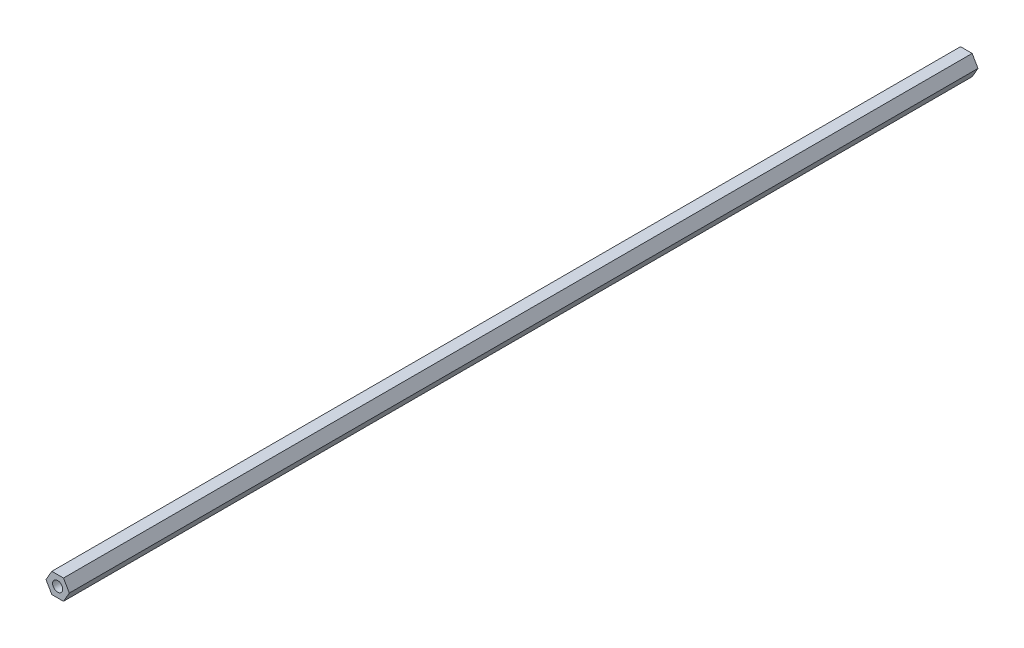
ISO-10303-21;
HEADER;
FILE_DESCRIPTION(('STEP AP214'),'2;1');
FILE_NAME('part.step','',(''),(''),'','','');
FILE_SCHEMA(('AUTOMOTIVE_DESIGN { 1 0 10303 214 1 1 1 1 }'));
ENDSEC;
DATA;
#1=APPLICATION_CONTEXT('core data for automotive mechanical design processes');
#2=APPLICATION_PROTOCOL_DEFINITION('international standard','automotive_design',2000,#1);
#3=PRODUCT_CONTEXT('',#1,'mechanical');
#4=PRODUCT('Part','Part','',(#3));
#5=PRODUCT_RELATED_PRODUCT_CATEGORY('part','',(#4));
#6=PRODUCT_DEFINITION_FORMATION('','',#4);
#7=PRODUCT_DEFINITION_CONTEXT('part definition',#1,'design');
#8=PRODUCT_DEFINITION('design','',#6,#7);
#9=PRODUCT_DEFINITION_SHAPE('','',#8);
#10=(LENGTH_UNIT() NAMED_UNIT(*) SI_UNIT(.MILLI.,.METRE.));
#11=(NAMED_UNIT(*) PLANE_ANGLE_UNIT() SI_UNIT($,.RADIAN.));
#12=(NAMED_UNIT(*) SI_UNIT($,.STERADIAN.) SOLID_ANGLE_UNIT());
#13=UNCERTAINTY_MEASURE_WITH_UNIT(LENGTH_MEASURE(1.E-05),#10,'distance_accuracy_value','');
#14=(GEOMETRIC_REPRESENTATION_CONTEXT(3) GLOBAL_UNCERTAINTY_ASSIGNED_CONTEXT((#13)) GLOBAL_UNIT_ASSIGNED_CONTEXT((#10,
#11,#12)) REPRESENTATION_CONTEXT('',''));
#15=CARTESIAN_POINT('',(0.,0.,0.));
#16=DIRECTION('',(0.,0.,1.));
#17=DIRECTION('',(1.,0.,0.));
#18=AXIS2_PLACEMENT_3D('',#15,#16,#17);
#19=CARTESIAN_POINT('',(0.,6.35,559.282920441985));
#20=DIRECTION('',(0.,-1.,0.));
#21=DIRECTION('',(1.,0.,0.));
#22=AXIS2_PLACEMENT_3D('',#19,#20,#21);
#23=PLANE('',#22);
#24=DIRECTION('',(-1.,0.,0.));
#25=VECTOR('',#24,1.);
#26=CARTESIAN_POINT('',(1.41251224281279E-13,6.35,514.483350000005));
#27=LINE('',#26,#25);
#28=CARTESIAN_POINT('',(3.66617420935413,6.35,514.483350000005));
#29=VERTEX_POINT('',#28);
#30=CARTESIAN_POINT('',(-3.66617420935413,6.35,514.483350000005));
#31=VERTEX_POINT('',#30);
#32=EDGE_CURVE('E117',#29,#31,#27,.T.);
#33=ORIENTED_EDGE('',*,*,#32,.F.);
#34=DIRECTION('',(0.,0.,-1.));
#35=VECTOR('',#34,1.);
#36=CARTESIAN_POINT('',(3.66617420935413,6.35,559.282920441985));
#37=LINE('',#36,#35);
#38=CARTESIAN_POINT('',(3.66617420935408,6.35000000000003,-57.0166499999946));
#39=VERTEX_POINT('',#38);
#40=EDGE_CURVE('E61',#29,#39,#37,.T.);
#41=ORIENTED_EDGE('',*,*,#40,.T.);
#42=DIRECTION('',(-1.,0.,0.));
#43=VECTOR('',#42,1.);
#44=CARTESIAN_POINT('',(3.66617420935408,6.35000000000003,-57.0166499999946));
#45=LINE('',#44,#43);
#46=CARTESIAN_POINT('',(-3.66617420935419,6.34999999999997,-57.0166499999946));
#47=VERTEX_POINT('',#46);
#48=EDGE_CURVE('E146',#39,#47,#45,.T.);
#49=ORIENTED_EDGE('',*,*,#48,.T.);
#50=DIRECTION('',(0.,0.,-1.));
#51=VECTOR('',#50,1.);
#52=CARTESIAN_POINT('',(-3.66617420935413,6.35,559.282920441985));
#53=LINE('',#52,#51);
#54=EDGE_CURVE('E125',#31,#47,#53,.T.);
#55=ORIENTED_EDGE('',*,*,#54,.F.);
#56=EDGE_LOOP('',(#33,#41,#49,#55));
#57=FACE_BOUND('',#56,.T.);
#58=ADVANCED_FACE('F43',(#57),#23,.F.);
#59=CARTESIAN_POINT('',(-5.49926131403119,3.175,559.282920441985));
#60=DIRECTION('',(0.866025403784439,-0.5,0.));
#61=DIRECTION('',(0.5,0.866025403784439,0.));
#62=AXIS2_PLACEMENT_3D('',#59,#60,#61);
#63=PLANE('',#62);
#64=DIRECTION('',(-0.5,-0.866025403784439,0.));
#65=VECTOR('',#64,1.);
#66=CARTESIAN_POINT('',(-5.49926131403126,3.17499999999988,514.483350000005));
#67=LINE('',#66,#65);
#68=CARTESIAN_POINT('',(-7.33234841870824,0.,514.483350000005));
#69=VERTEX_POINT('',#68);
#70=EDGE_CURVE('E113',#31,#69,#67,.T.);
#71=ORIENTED_EDGE('',*,*,#70,.F.);
#72=ORIENTED_EDGE('',*,*,#54,.T.);
#73=DIRECTION('',(-0.49999999999999,-0.866025403784444,0.));
#74=VECTOR('',#73,1.);
#75=CARTESIAN_POINT('',(-3.66617420935419,6.34999999999997,-57.0166499999946));
#76=LINE('',#75,#74);
#77=CARTESIAN_POINT('',(-7.33234841870825,0.,-57.0166499999946));
#78=VERTEX_POINT('',#77);
#79=EDGE_CURVE('E141',#47,#78,#76,.T.);
#80=ORIENTED_EDGE('',*,*,#79,.T.);
#81=DIRECTION('',(0.,0.,-1.));
#82=VECTOR('',#81,1.);
#83=CARTESIAN_POINT('',(-7.33234841870824,0.,559.282920441985));
#84=LINE('',#83,#82);
#85=EDGE_CURVE('E108',#69,#78,#84,.T.);
#86=ORIENTED_EDGE('',*,*,#85,.F.);
#87=EDGE_LOOP('',(#71,#72,#80,#86));
#88=FACE_BOUND('',#87,.T.);
#89=ADVANCED_FACE('F185',(#88),#63,.F.);
#90=CARTESIAN_POINT('',(-5.49926131403119,-3.175,559.282920441985));
#91=DIRECTION('',(0.866025403784439,0.5,0.));
#92=DIRECTION('',(-0.5,0.866025403784439,0.));
#93=AXIS2_PLACEMENT_3D('',#90,#91,#92);
#94=PLANE('',#93);
#95=DIRECTION('',(0.5,-0.866025403784439,0.));
#96=VECTOR('',#95,1.);
#97=CARTESIAN_POINT('',(-5.49926131403104,-3.17500000000024,514.483350000005));
#98=LINE('',#97,#96);
#99=CARTESIAN_POINT('',(-3.66617420935412,-6.35000000000001,514.483350000005));
#100=VERTEX_POINT('',#99);
#101=EDGE_CURVE('E98',#69,#100,#98,.T.);
#102=ORIENTED_EDGE('',*,*,#101,.F.);
#103=ORIENTED_EDGE('',*,*,#85,.T.);
#104=DIRECTION('',(0.500000000000006,-0.866025403784435,0.));
#105=VECTOR('',#104,1.);
#106=CARTESIAN_POINT('',(-7.33234841870825,0.,-57.0166499999946));
#107=LINE('',#106,#105);
#108=CARTESIAN_POINT('',(-3.66617420935412,-6.35000000000001,-57.0166499999946));
#109=VERTEX_POINT('',#108);
#110=EDGE_CURVE('E106',#78,#109,#107,.T.);
#111=ORIENTED_EDGE('',*,*,#110,.T.);
#112=DIRECTION('',(0.,0.,-1.));
#113=VECTOR('',#112,1.);
#114=CARTESIAN_POINT('',(-3.66617420935412,-6.35000000000001,559.282920441985));
#115=LINE('',#114,#113);
#116=EDGE_CURVE('E91',#100,#109,#115,.T.);
#117=ORIENTED_EDGE('',*,*,#116,.F.);
#118=EDGE_LOOP('',(#102,#103,#111,#117));
#119=FACE_BOUND('',#118,.T.);
#120=ADVANCED_FACE('F102',(#119),#94,.F.);
#121=CARTESIAN_POINT('',(0.,-6.35000000000001,559.282920441985));
#122=DIRECTION('',(0.,1.,0.));
#123=DIRECTION('',(-1.,0.,0.));
#124=AXIS2_PLACEMENT_3D('',#121,#122,#123);
#125=PLANE('',#124);
#126=DIRECTION('',(1.,0.,0.));
#127=VECTOR('',#126,1.);
#128=CARTESIAN_POINT('',(1.47260482676227E-13,-6.35000000000001,514.483350000005));
#129=LINE('',#128,#127);
#130=CARTESIAN_POINT('',(3.66617420935413,-6.35,514.483350000005));
#131=VERTEX_POINT('',#130);
#132=EDGE_CURVE('E53',#100,#131,#129,.T.);
#133=ORIENTED_EDGE('',*,*,#132,.F.);
#134=ORIENTED_EDGE('',*,*,#116,.T.);
#135=DIRECTION('',(1.,0.,0.));
#136=VECTOR('',#135,1.);
#137=CARTESIAN_POINT('',(-3.66617420935412,-6.35000000000001,-57.0166499999946));
#138=LINE('',#137,#136);
#139=CARTESIAN_POINT('',(3.66617420935415,-6.34999999999999,-57.0166499999946));
#140=VERTEX_POINT('',#139);
#141=EDGE_CURVE('E159',#109,#140,#138,.T.);
#142=ORIENTED_EDGE('',*,*,#141,.T.);
#143=DIRECTION('',(0.,0.,-1.));
#144=VECTOR('',#143,1.);
#145=CARTESIAN_POINT('',(3.66617420935413,-6.35,559.282920441985));
#146=LINE('',#145,#144);
#147=EDGE_CURVE('E94',#131,#140,#146,.T.);
#148=ORIENTED_EDGE('',*,*,#147,.F.);
#149=EDGE_LOOP('',(#133,#134,#142,#148));
#150=FACE_BOUND('',#149,.T.);
#151=ADVANCED_FACE('F88',(#150),#125,.F.);
#152=CARTESIAN_POINT('',(5.49926131403119,-3.175,559.282920441985));
#153=DIRECTION('',(-0.866025403784439,0.5,0.));
#154=DIRECTION('',(-0.5,-0.866025403784439,0.));
#155=AXIS2_PLACEMENT_3D('',#152,#153,#154);
#156=PLANE('',#155);
#157=DIRECTION('',(0.5,0.866025403784439,0.));
#158=VECTOR('',#157,1.);
#159=CARTESIAN_POINT('',(5.49926131403112,-3.17500000000012,514.483350000005));
#160=LINE('',#159,#158);
#161=CARTESIAN_POINT('',(7.33234841870825,0.,514.483350000005));
#162=VERTEX_POINT('',#161);
#163=EDGE_CURVE('E11',#131,#162,#160,.T.);
#164=ORIENTED_EDGE('',*,*,#163,.F.);
#165=ORIENTED_EDGE('',*,*,#147,.T.);
#166=DIRECTION('',(0.499999999999996,0.866025403784441,0.));
#167=VECTOR('',#166,1.);
#168=CARTESIAN_POINT('',(3.66617420935415,-6.34999999999999,-57.0166499999946));
#169=LINE('',#168,#167);
#170=CARTESIAN_POINT('',(7.33234841870825,0.,-57.0166499999946));
#171=VERTEX_POINT('',#170);
#172=EDGE_CURVE('E156',#140,#171,#169,.T.);
#173=ORIENTED_EDGE('',*,*,#172,.T.);
#174=DIRECTION('',(0.,0.,-1.));
#175=VECTOR('',#174,1.);
#176=CARTESIAN_POINT('',(7.33234841870825,0.,559.282920441985));
#177=LINE('',#176,#175);
#178=EDGE_CURVE('E70',#162,#171,#177,.T.);
#179=ORIENTED_EDGE('',*,*,#178,.F.);
#180=EDGE_LOOP('',(#164,#165,#173,#179));
#181=FACE_BOUND('',#180,.T.);
#182=ADVANCED_FACE('F195',(#181),#156,.F.);
#183=CARTESIAN_POINT('',(5.49926131403119,3.17500000000001,559.282920441985));
#184=DIRECTION('',(-0.866025403784438,-0.500000000000001,0.));
#185=DIRECTION('',(0.500000000000001,-0.866025403784438,0.));
#186=AXIS2_PLACEMENT_3D('',#183,#184,#185);
#187=PLANE('',#186);
#188=DIRECTION('',(-0.500000000000001,0.866025403784438,0.));
#189=VECTOR('',#188,1.);
#190=CARTESIAN_POINT('',(5.49926131403133,3.17499999999976,514.483350000005));
#191=LINE('',#190,#189);
#192=EDGE_CURVE('E122',#162,#29,#191,.T.);
#193=ORIENTED_EDGE('',*,*,#192,.F.);
#194=ORIENTED_EDGE('',*,*,#178,.T.);
#195=DIRECTION('',(-0.500000000000006,0.866025403784435,0.));
#196=VECTOR('',#195,1.);
#197=CARTESIAN_POINT('',(7.33234841870825,0.,-57.0166499999946));
#198=LINE('',#197,#196);
#199=EDGE_CURVE('E151',#171,#39,#198,.T.);
#200=ORIENTED_EDGE('',*,*,#199,.T.);
#201=ORIENTED_EDGE('',*,*,#40,.F.);
#202=EDGE_LOOP('',(#193,#194,#200,#201));
#203=FACE_BOUND('',#202,.T.);
#204=ADVANCED_FACE('F181',(#203),#187,.F.);
#205=CARTESIAN_POINT('',(7.77874999999913,-13.4731902193747,514.483350000006));
#206=DIRECTION('',(0.,0.,1.));
#207=DIRECTION('',(0.5,-0.866025403784438,0.));
#208=AXIS2_PLACEMENT_3D('',#205,#206,#207);
#209=PLANE('',#208);
#210=CARTESIAN_POINT('',(0.,0.,514.483350000005));
#211=DIRECTION('',(0.,0.,1.));
#212=DIRECTION('',(0.,-1.,0.));
#213=AXIS2_PLACEMENT_3D('',#210,#211,#212);
#214=CIRCLE('',#213,3.17499999999746);
#215=CARTESIAN_POINT('',(0.,-3.17499999999746,514.483350000005));
#216=VERTEX_POINT('',#215);
#217=EDGE_CURVE('E47',#216,#216,#214,.T.);
#218=ORIENTED_EDGE('',*,*,#217,.F.);
#219=EDGE_LOOP('',(#218));
#220=FACE_BOUND('',#219,.T.);
#221=ORIENTED_EDGE('',*,*,#192,.T.);
#222=ORIENTED_EDGE('',*,*,#32,.T.);
#223=ORIENTED_EDGE('',*,*,#70,.T.);
#224=ORIENTED_EDGE('',*,*,#101,.T.);
#225=ORIENTED_EDGE('',*,*,#132,.T.);
#226=ORIENTED_EDGE('',*,*,#163,.T.);
#227=EDGE_LOOP('',(#221,#222,#223,#224,#225,#226));
#228=FACE_BOUND('',#227,.T.);
#229=ADVANCED_FACE('F45',(#220,#228),#209,.T.);
#230=CARTESIAN_POINT('',(0.,0.,0.));
#231=DIRECTION('',(0.,0.,1.));
#232=DIRECTION('',(1.,0.,0.));
#233=AXIS2_PLACEMENT_3D('',#230,#231,#232);
#234=CYLINDRICAL_SURFACE('',#233,3.17499999999746);
#235=ORIENTED_EDGE('',*,*,#217,.T.);
#236=EDGE_LOOP('',(#235));
#237=FACE_BOUND('',#236,.T.);
#238=CARTESIAN_POINT('',(0.,0.,-57.0166499999946));
#239=DIRECTION('',(0.,0.,1.));
#240=DIRECTION('',(1.,0.,0.));
#241=AXIS2_PLACEMENT_3D('',#238,#239,#240);
#242=CIRCLE('',#241,3.17499999999746);
#243=CARTESIAN_POINT('',(3.17499999999746,0.,-57.0166499999946));
#244=VERTEX_POINT('',#243);
#245=EDGE_CURVE('E164',#244,#244,#242,.T.);
#246=ORIENTED_EDGE('',*,*,#245,.F.);
#247=EDGE_LOOP('',(#246));
#248=FACE_BOUND('',#247,.T.);
#249=ADVANCED_FACE('F172',(#237,#248),#234,.F.);
#250=CARTESIAN_POINT('',(0.,0.,-57.0166499999946));
#251=DIRECTION('',(0.,0.,1.));
#252=DIRECTION('',(1.,0.,0.));
#253=AXIS2_PLACEMENT_3D('',#250,#251,#252);
#254=PLANE('',#253);
#255=ORIENTED_EDGE('',*,*,#245,.T.);
#256=EDGE_LOOP('',(#255));
#257=FACE_BOUND('',#256,.T.);
#258=ORIENTED_EDGE('',*,*,#110,.F.);
#259=ORIENTED_EDGE('',*,*,#79,.F.);
#260=ORIENTED_EDGE('',*,*,#48,.F.);
#261=ORIENTED_EDGE('',*,*,#199,.F.);
#262=ORIENTED_EDGE('',*,*,#172,.F.);
#263=ORIENTED_EDGE('',*,*,#141,.F.);
#264=EDGE_LOOP('',(#258,#259,#260,#261,#262,#263));
#265=FACE_BOUND('',#264,.T.);
#266=ADVANCED_FACE('F169',(#257,#265),#254,.F.);
#267=CLOSED_SHELL('',(#58,#89,#120,#151,#182,#204,#229,#249,#266));
#268=MANIFOLD_SOLID_BREP('B2',#267);
#269=ADVANCED_BREP_SHAPE_REPRESENTATION('',(#18,#268),#14);
#270=SHAPE_DEFINITION_REPRESENTATION(#9,#269);
ENDSEC;
END-ISO-10303-21;
